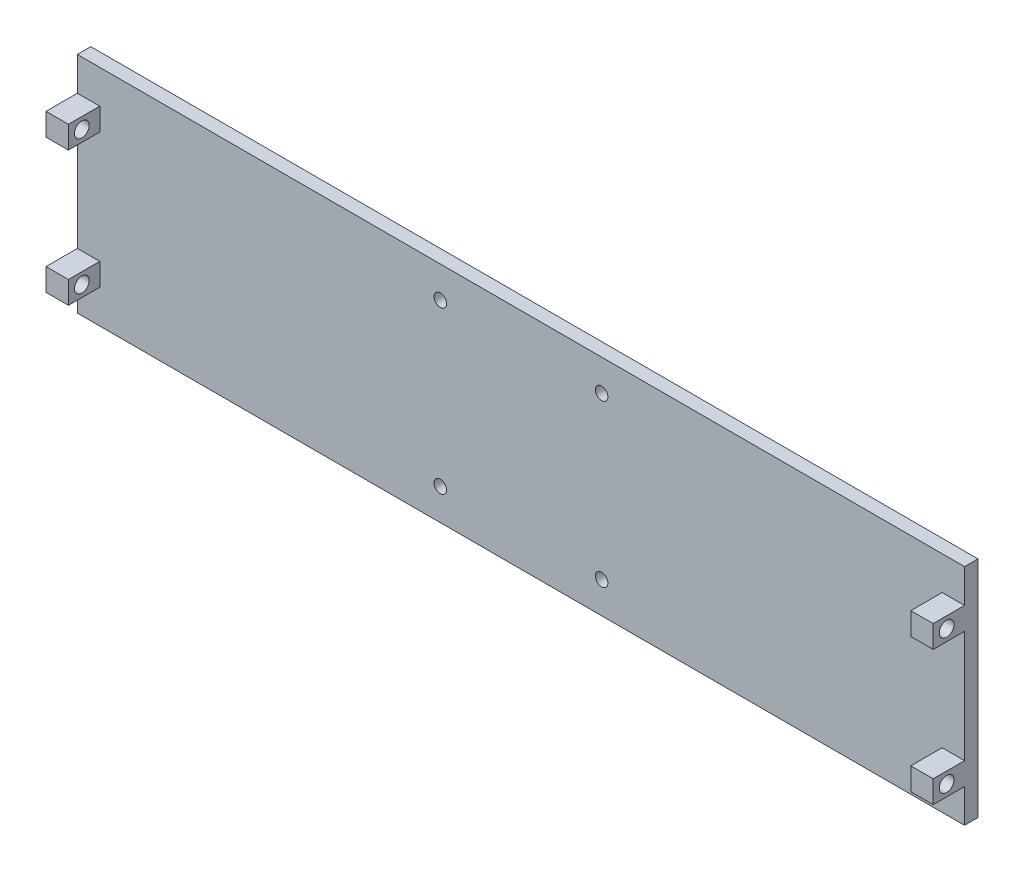
ISO-10303-21;
HEADER;
FILE_DESCRIPTION(('STEP AP214'),'2;1');
FILE_NAME('part.step','',(''),(''),'','','');
FILE_SCHEMA(('AUTOMOTIVE_DESIGN { 1 0 10303 214 1 1 1 1 }'));
ENDSEC;
DATA;
#1=APPLICATION_CONTEXT('core data for automotive mechanical design processes');
#2=APPLICATION_PROTOCOL_DEFINITION('international standard','automotive_design',2000,#1);
#3=PRODUCT_CONTEXT('',#1,'mechanical');
#4=PRODUCT('Part','Part','',(#3));
#5=PRODUCT_RELATED_PRODUCT_CATEGORY('part','',(#4));
#6=PRODUCT_DEFINITION_FORMATION('','',#4);
#7=PRODUCT_DEFINITION_CONTEXT('part definition',#1,'design');
#8=PRODUCT_DEFINITION('design','',#6,#7);
#9=PRODUCT_DEFINITION_SHAPE('','',#8);
#10=(LENGTH_UNIT() NAMED_UNIT(*) SI_UNIT(.MILLI.,.METRE.));
#11=(NAMED_UNIT(*) PLANE_ANGLE_UNIT() SI_UNIT($,.RADIAN.));
#12=(NAMED_UNIT(*) SI_UNIT($,.STERADIAN.) SOLID_ANGLE_UNIT());
#13=UNCERTAINTY_MEASURE_WITH_UNIT(LENGTH_MEASURE(1.E-05),#10,'distance_accuracy_value','');
#14=(GEOMETRIC_REPRESENTATION_CONTEXT(3) GLOBAL_UNCERTAINTY_ASSIGNED_CONTEXT((#13)) GLOBAL_UNIT_ASSIGNED_CONTEXT((#10,
#11,#12)) REPRESENTATION_CONTEXT('',''));
#15=CARTESIAN_POINT('',(0.,0.,0.));
#16=DIRECTION('',(0.,0.,1.));
#17=DIRECTION('',(1.,0.,0.));
#18=AXIS2_PLACEMENT_3D('',#15,#16,#17);
#19=CARTESIAN_POINT('',(0.,0.,3.));
#20=DIRECTION('',(0.,0.,-1.));
#21=DIRECTION('',(-1.,0.,0.));
#22=AXIS2_PLACEMENT_3D('',#19,#20,#21);
#23=PLANE('',#22);
#24=CARTESIAN_POINT('',(18.0000000000001,17.9999999999999,3.));
#25=DIRECTION('',(0.,0.,1.));
#26=DIRECTION('',(1.,0.,0.));
#27=AXIS2_PLACEMENT_3D('',#24,#25,#26);
#28=CIRCLE('',#27,1.4);
#29=CARTESIAN_POINT('',(19.4000000000001,17.9999999999999,3.));
#30=VERTEX_POINT('',#29);
#31=EDGE_CURVE('E750',#30,#30,#28,.T.);
#32=ORIENTED_EDGE('',*,*,#31,.F.);
#33=EDGE_LOOP('',(#32));
#34=FACE_BOUND('',#33,.T.);
#35=CARTESIAN_POINT('',(17.9999999999999,-18.0000000000001,3.));
#36=DIRECTION('',(0.,0.,1.));
#37=DIRECTION('',(1.,0.,0.));
#38=AXIS2_PLACEMENT_3D('',#35,#36,#37);
#39=CIRCLE('',#38,1.4);
#40=CARTESIAN_POINT('',(19.3999999999999,-18.0000000000001,3.));
#41=VERTEX_POINT('',#40);
#42=EDGE_CURVE('E757',#41,#41,#39,.T.);
#43=ORIENTED_EDGE('',*,*,#42,.F.);
#44=EDGE_LOOP('',(#43));
#45=FACE_BOUND('',#44,.T.);
#46=CARTESIAN_POINT('',(-18.0000000000002,-17.9999999999998,3.));
#47=DIRECTION('',(0.,0.,1.));
#48=DIRECTION('',(1.,0.,0.));
#49=AXIS2_PLACEMENT_3D('',#46,#47,#48);
#50=CIRCLE('',#49,1.4);
#51=CARTESIAN_POINT('',(-16.6000000000002,-17.9999999999998,3.));
#52=VERTEX_POINT('',#51);
#53=EDGE_CURVE('E767',#52,#52,#50,.T.);
#54=ORIENTED_EDGE('',*,*,#53,.F.);
#55=EDGE_LOOP('',(#54));
#56=FACE_BOUND('',#55,.T.);
#57=CARTESIAN_POINT('',(-18.,18.,3.));
#58=DIRECTION('',(0.,0.,1.));
#59=DIRECTION('',(1.,0.,0.));
#60=AXIS2_PLACEMENT_3D('',#57,#58,#59);
#61=CIRCLE('',#60,1.4);
#62=CARTESIAN_POINT('',(-16.6,18.,3.));
#63=VERTEX_POINT('',#62);
#64=EDGE_CURVE('E253',#63,#63,#61,.T.);
#65=ORIENTED_EDGE('',*,*,#64,.F.);
#66=EDGE_LOOP('',(#65));
#67=FACE_BOUND('',#66,.T.);
#68=DIRECTION('',(-1.,0.,0.));
#69=VECTOR('',#68,1.);
#70=CARTESIAN_POINT('',(0.,-12.5,3.));
#71=LINE('',#70,#69);
#72=CARTESIAN_POINT('',(99.,-12.5,3.));
#73=VERTEX_POINT('',#72);
#74=CARTESIAN_POINT('',(94.,-12.5,3.));
#75=VERTEX_POINT('',#74);
#76=EDGE_CURVE('E244',#73,#75,#71,.T.);
#77=ORIENTED_EDGE('',*,*,#76,.F.);
#78=DIRECTION('',(0.,1.,0.));
#79=VECTOR('',#78,1.);
#80=CARTESIAN_POINT('',(99.,-25.,3.));
#81=LINE('',#80,#79);
#82=CARTESIAN_POINT('',(99.,12.5,3.));
#83=VERTEX_POINT('',#82);
#84=EDGE_CURVE('E426',#73,#83,#81,.T.);
#85=ORIENTED_EDGE('',*,*,#84,.T.);
#86=DIRECTION('',(1.,0.,0.));
#87=VECTOR('',#86,1.);
#88=CARTESIAN_POINT('',(0.,12.5,3.));
#89=LINE('',#88,#87);
#90=CARTESIAN_POINT('',(94.,12.5,3.));
#91=VERTEX_POINT('',#90);
#92=EDGE_CURVE('E312',#91,#83,#89,.T.);
#93=ORIENTED_EDGE('',*,*,#92,.F.);
#94=DIRECTION('',(0.,-1.,0.));
#95=VECTOR('',#94,1.);
#96=CARTESIAN_POINT('',(94.,0.,3.));
#97=LINE('',#96,#95);
#98=CARTESIAN_POINT('',(94.,17.5,3.));
#99=VERTEX_POINT('',#98);
#100=EDGE_CURVE('E271',#99,#91,#97,.T.);
#101=ORIENTED_EDGE('',*,*,#100,.F.);
#102=DIRECTION('',(1.,0.,0.));
#103=VECTOR('',#102,1.);
#104=CARTESIAN_POINT('',(0.,17.5,3.));
#105=LINE('',#104,#103);
#106=CARTESIAN_POINT('',(99.,17.5,3.));
#107=VERTEX_POINT('',#106);
#108=EDGE_CURVE('E316',#99,#107,#105,.T.);
#109=ORIENTED_EDGE('',*,*,#108,.T.);
#110=CARTESIAN_POINT('',(99.,25.,3.));
#111=VERTEX_POINT('',#110);
#112=EDGE_CURVE('E427',#107,#111,#81,.T.);
#113=ORIENTED_EDGE('',*,*,#112,.T.);
#114=DIRECTION('',(-1.,0.,0.));
#115=VECTOR('',#114,1.);
#116=CARTESIAN_POINT('',(-99.,25.,3.));
#117=LINE('',#116,#115);
#118=CARTESIAN_POINT('',(-99.,25.,3.));
#119=VERTEX_POINT('',#118);
#120=EDGE_CURVE('E425',#111,#119,#117,.T.);
#121=ORIENTED_EDGE('',*,*,#120,.T.);
#122=DIRECTION('',(0.,-1.,0.));
#123=VECTOR('',#122,1.);
#124=CARTESIAN_POINT('',(-99.,-25.,3.));
#125=LINE('',#124,#123);
#126=CARTESIAN_POINT('',(-99.,17.5,3.));
#127=VERTEX_POINT('',#126);
#128=EDGE_CURVE('E431',#119,#127,#125,.T.);
#129=ORIENTED_EDGE('',*,*,#128,.T.);
#130=DIRECTION('',(-1.,0.,0.));
#131=VECTOR('',#130,1.);
#132=CARTESIAN_POINT('',(0.,17.5,3.));
#133=LINE('',#132,#131);
#134=CARTESIAN_POINT('',(-94.,17.5,3.));
#135=VERTEX_POINT('',#134);
#136=EDGE_CURVE('E413',#135,#127,#133,.T.);
#137=ORIENTED_EDGE('',*,*,#136,.F.);
#138=DIRECTION('',(0.,1.,0.));
#139=VECTOR('',#138,1.);
#140=CARTESIAN_POINT('',(-94.,0.,3.));
#141=LINE('',#140,#139);
#142=CARTESIAN_POINT('',(-94.,12.5,3.));
#143=VERTEX_POINT('',#142);
#144=EDGE_CURVE('E409',#143,#135,#141,.T.);
#145=ORIENTED_EDGE('',*,*,#144,.F.);
#146=DIRECTION('',(-1.,0.,0.));
#147=VECTOR('',#146,1.);
#148=CARTESIAN_POINT('',(0.,12.5,3.));
#149=LINE('',#148,#147);
#150=CARTESIAN_POINT('',(-99.,12.5,3.));
#151=VERTEX_POINT('',#150);
#152=EDGE_CURVE('E417',#143,#151,#149,.T.);
#153=ORIENTED_EDGE('',*,*,#152,.T.);
#154=CARTESIAN_POINT('',(-99.,-12.5,3.));
#155=VERTEX_POINT('',#154);
#156=EDGE_CURVE('E435',#151,#155,#125,.T.);
#157=ORIENTED_EDGE('',*,*,#156,.T.);
#158=DIRECTION('',(-1.,0.,0.));
#159=VECTOR('',#158,1.);
#160=CARTESIAN_POINT('',(0.,-12.5,3.));
#161=LINE('',#160,#159);
#162=CARTESIAN_POINT('',(-94.,-12.5,3.));
#163=VERTEX_POINT('',#162);
#164=EDGE_CURVE('E405',#163,#155,#161,.T.);
#165=ORIENTED_EDGE('',*,*,#164,.F.);
#166=DIRECTION('',(0.,1.,0.));
#167=VECTOR('',#166,1.);
#168=CARTESIAN_POINT('',(-94.,0.,3.));
#169=LINE('',#168,#167);
#170=CARTESIAN_POINT('',(-94.,-17.5,3.));
#171=VERTEX_POINT('',#170);
#172=EDGE_CURVE('E360',#171,#163,#169,.T.);
#173=ORIENTED_EDGE('',*,*,#172,.F.);
#174=DIRECTION('',(-1.,0.,0.));
#175=VECTOR('',#174,1.);
#176=CARTESIAN_POINT('',(0.,-17.5,3.));
#177=LINE('',#176,#175);
#178=CARTESIAN_POINT('',(-99.,-17.5,3.));
#179=VERTEX_POINT('',#178);
#180=EDGE_CURVE('E401',#171,#179,#177,.T.);
#181=ORIENTED_EDGE('',*,*,#180,.T.);
#182=CARTESIAN_POINT('',(-99.,-25.,3.));
#183=VERTEX_POINT('',#182);
#184=EDGE_CURVE('E430',#179,#183,#125,.T.);
#185=ORIENTED_EDGE('',*,*,#184,.T.);
#186=DIRECTION('',(1.,0.,0.));
#187=VECTOR('',#186,1.);
#188=CARTESIAN_POINT('',(-99.,-25.,3.));
#189=LINE('',#188,#187);
#190=CARTESIAN_POINT('',(99.,-25.,3.));
#191=VERTEX_POINT('',#190);
#192=EDGE_CURVE('E434',#183,#191,#189,.T.);
#193=ORIENTED_EDGE('',*,*,#192,.T.);
#194=CARTESIAN_POINT('',(99.,-17.5,3.));
#195=VERTEX_POINT('',#194);
#196=EDGE_CURVE('E422',#191,#195,#81,.T.);
#197=ORIENTED_EDGE('',*,*,#196,.T.);
#198=DIRECTION('',(-1.,0.,0.));
#199=VECTOR('',#198,1.);
#200=CARTESIAN_POINT('',(0.,-17.5,3.));
#201=LINE('',#200,#199);
#202=CARTESIAN_POINT('',(94.,-17.5,3.));
#203=VERTEX_POINT('',#202);
#204=EDGE_CURVE('E99',#195,#203,#201,.T.);
#205=ORIENTED_EDGE('',*,*,#204,.T.);
#206=DIRECTION('',(0.,-1.,0.));
#207=VECTOR('',#206,1.);
#208=CARTESIAN_POINT('',(94.,0.,3.));
#209=LINE('',#208,#207);
#210=EDGE_CURVE('E103',#75,#203,#209,.T.);
#211=ORIENTED_EDGE('',*,*,#210,.F.);
#212=EDGE_LOOP('',(#77,#85,#93,#101,#109,#113,#121,#129,#137,#145,#153,#157,#165,#173,#181,#185,
#193,#197,#205,#211));
#213=FACE_BOUND('',#212,.T.);
#214=ADVANCED_FACE('F83',(#34,#45,#56,#67,#213),#23,.F.);
#215=CARTESIAN_POINT('',(99.,-25.,3.));
#216=DIRECTION('',(-1.,0.,0.));
#217=DIRECTION('',(0.,0.,1.));
#218=AXIS2_PLACEMENT_3D('',#215,#216,#217);
#219=PLANE('',#218);
#220=ORIENTED_EDGE('',*,*,#112,.F.);
#221=DIRECTION('',(0.,0.,1.));
#222=VECTOR('',#221,1.);
#223=CARTESIAN_POINT('',(99.,17.5,0.));
#224=LINE('',#223,#222);
#225=CARTESIAN_POINT('',(99.,17.5,10.));
#226=VERTEX_POINT('',#225);
#227=EDGE_CURVE('E291',#107,#226,#224,.T.);
#228=ORIENTED_EDGE('',*,*,#227,.T.);
#229=DIRECTION('',(0.,1.,0.));
#230=VECTOR('',#229,1.);
#231=CARTESIAN_POINT('',(99.,12.5,10.));
#232=LINE('',#231,#230);
#233=CARTESIAN_POINT('',(99.,12.5,10.));
#234=VERTEX_POINT('',#233);
#235=EDGE_CURVE('E286',#234,#226,#232,.T.);
#236=ORIENTED_EDGE('',*,*,#235,.F.);
#237=DIRECTION('',(0.,0.,1.));
#238=VECTOR('',#237,1.);
#239=CARTESIAN_POINT('',(99.,12.5,0.));
#240=LINE('',#239,#238);
#241=EDGE_CURVE('E283',#83,#234,#240,.T.);
#242=ORIENTED_EDGE('',*,*,#241,.F.);
#243=ORIENTED_EDGE('',*,*,#84,.F.);
#244=DIRECTION('',(0.,0.,-1.));
#245=VECTOR('',#244,1.);
#246=CARTESIAN_POINT('',(99.,-12.5,0.));
#247=LINE('',#246,#245);
#248=CARTESIAN_POINT('',(99.,-12.5,10.));
#249=VERTEX_POINT('',#248);
#250=EDGE_CURVE('E261',#249,#73,#247,.T.);
#251=ORIENTED_EDGE('',*,*,#250,.F.);
#252=DIRECTION('',(0.,1.,0.));
#253=VECTOR('',#252,1.);
#254=CARTESIAN_POINT('',(99.,0.,10.));
#255=LINE('',#254,#253);
#256=CARTESIAN_POINT('',(99.,-17.5,10.));
#257=VERTEX_POINT('',#256);
#258=EDGE_CURVE('E235',#257,#249,#255,.T.);
#259=ORIENTED_EDGE('',*,*,#258,.F.);
#260=DIRECTION('',(0.,0.,-1.));
#261=VECTOR('',#260,1.);
#262=CARTESIAN_POINT('',(99.,-17.5,0.));
#263=LINE('',#262,#261);
#264=EDGE_CURVE('E250',#257,#195,#263,.T.);
#265=ORIENTED_EDGE('',*,*,#264,.T.);
#266=ORIENTED_EDGE('',*,*,#196,.F.);
#267=DIRECTION('',(0.,0.,-1.));
#268=VECTOR('',#267,1.);
#269=CARTESIAN_POINT('',(99.,-25.,3.));
#270=LINE('',#269,#268);
#271=CARTESIAN_POINT('',(99.,-25.,0.));
#272=VERTEX_POINT('',#271);
#273=EDGE_CURVE('E438',#191,#272,#270,.T.);
#274=ORIENTED_EDGE('',*,*,#273,.T.);
#275=DIRECTION('',(0.,1.,0.));
#276=VECTOR('',#275,1.);
#277=CARTESIAN_POINT('',(99.,-25.,0.));
#278=LINE('',#277,#276);
#279=CARTESIAN_POINT('',(99.,25.,0.));
#280=VERTEX_POINT('',#279);
#281=EDGE_CURVE('E421',#272,#280,#278,.T.);
#282=ORIENTED_EDGE('',*,*,#281,.T.);
#283=DIRECTION('',(0.,0.,-1.));
#284=VECTOR('',#283,1.);
#285=CARTESIAN_POINT('',(99.,25.,3.));
#286=LINE('',#285,#284);
#287=EDGE_CURVE('E12',#111,#280,#286,.T.);
#288=ORIENTED_EDGE('',*,*,#287,.F.);
#289=EDGE_LOOP('',(#220,#228,#236,#242,#243,#251,#259,#265,#266,#274,#282,#288));
#290=FACE_BOUND('',#289,.T.);
#291=CARTESIAN_POINT('',(99.,15.,7.));
#292=DIRECTION('',(1.,0.,0.));
#293=DIRECTION('',(0.,0.,-1.));
#294=AXIS2_PLACEMENT_3D('',#291,#292,#293);
#295=CIRCLE('',#294,1.65);
#296=CARTESIAN_POINT('',(99.,15.,5.35));
#297=VERTEX_POINT('',#296);
#298=EDGE_CURVE('E264',#297,#297,#295,.T.);
#299=ORIENTED_EDGE('',*,*,#298,.F.);
#300=EDGE_LOOP('',(#299));
#301=FACE_BOUND('',#300,.T.);
#302=CARTESIAN_POINT('',(99.,-15.,7.));
#303=DIRECTION('',(1.,0.,0.));
#304=DIRECTION('',(0.,0.,-1.));
#305=AXIS2_PLACEMENT_3D('',#302,#303,#304);
#306=CIRCLE('',#305,1.65);
#307=CARTESIAN_POINT('',(99.,-15.,5.35));
#308=VERTEX_POINT('',#307);
#309=EDGE_CURVE('E246',#308,#308,#306,.T.);
#310=ORIENTED_EDGE('',*,*,#309,.F.);
#311=EDGE_LOOP('',(#310));
#312=FACE_BOUND('',#311,.T.);
#313=ADVANCED_FACE('F85',(#290,#301,#312),#219,.F.);
#314=CARTESIAN_POINT('',(-99.,25.,3.));
#315=DIRECTION('',(0.,-1.,0.));
#316=DIRECTION('',(0.,0.,-1.));
#317=AXIS2_PLACEMENT_3D('',#314,#315,#316);
#318=PLANE('',#317);
#319=DIRECTION('',(-1.,0.,0.));
#320=VECTOR('',#319,1.);
#321=CARTESIAN_POINT('',(-99.,25.,0.));
#322=LINE('',#321,#320);
#323=CARTESIAN_POINT('',(-99.,25.,0.));
#324=VERTEX_POINT('',#323);
#325=EDGE_CURVE('E441',#280,#324,#322,.T.);
#326=ORIENTED_EDGE('',*,*,#325,.T.);
#327=DIRECTION('',(0.,0.,-1.));
#328=VECTOR('',#327,1.);
#329=CARTESIAN_POINT('',(-99.,25.,3.));
#330=LINE('',#329,#328);
#331=EDGE_CURVE('E92',#119,#324,#330,.T.);
#332=ORIENTED_EDGE('',*,*,#331,.F.);
#333=ORIENTED_EDGE('',*,*,#120,.F.);
#334=ORIENTED_EDGE('',*,*,#287,.T.);
#335=EDGE_LOOP('',(#326,#332,#333,#334));
#336=FACE_BOUND('',#335,.T.);
#337=ADVANCED_FACE('F491',(#336),#318,.F.);
#338=CARTESIAN_POINT('',(-99.,-25.,3.));
#339=DIRECTION('',(1.,0.,0.));
#340=DIRECTION('',(0.,0.,-1.));
#341=AXIS2_PLACEMENT_3D('',#338,#339,#340);
#342=PLANE('',#341);
#343=ORIENTED_EDGE('',*,*,#184,.F.);
#344=DIRECTION('',(0.,0.,1.));
#345=VECTOR('',#344,1.);
#346=CARTESIAN_POINT('',(-99.,-17.5,0.));
#347=LINE('',#346,#345);
#348=CARTESIAN_POINT('',(-99.,-17.5,10.));
#349=VERTEX_POINT('',#348);
#350=EDGE_CURVE('E382',#179,#349,#347,.T.);
#351=ORIENTED_EDGE('',*,*,#350,.T.);
#352=DIRECTION('',(0.,1.,0.));
#353=VECTOR('',#352,1.);
#354=CARTESIAN_POINT('',(-99.,0.,10.));
#355=LINE('',#354,#353);
#356=CARTESIAN_POINT('',(-99.,-12.5,10.));
#357=VERTEX_POINT('',#356);
#358=EDGE_CURVE('E385',#349,#357,#355,.T.);
#359=ORIENTED_EDGE('',*,*,#358,.T.);
#360=DIRECTION('',(0.,0.,1.));
#361=VECTOR('',#360,1.);
#362=CARTESIAN_POINT('',(-99.,-12.5,0.));
#363=LINE('',#362,#361);
#364=EDGE_CURVE('E325',#155,#357,#363,.T.);
#365=ORIENTED_EDGE('',*,*,#364,.F.);
#366=ORIENTED_EDGE('',*,*,#156,.F.);
#367=DIRECTION('',(0.,0.,1.));
#368=VECTOR('',#367,1.);
#369=CARTESIAN_POINT('',(-99.,12.5,0.));
#370=LINE('',#369,#368);
#371=CARTESIAN_POINT('',(-99.,12.5,10.));
#372=VERTEX_POINT('',#371);
#373=EDGE_CURVE('E350',#151,#372,#370,.T.);
#374=ORIENTED_EDGE('',*,*,#373,.T.);
#375=DIRECTION('',(0.,1.,0.));
#376=VECTOR('',#375,1.);
#377=CARTESIAN_POINT('',(-99.,0.,10.));
#378=LINE('',#377,#376);
#379=CARTESIAN_POINT('',(-99.,17.5,10.));
#380=VERTEX_POINT('',#379);
#381=EDGE_CURVE('E342',#372,#380,#378,.T.);
#382=ORIENTED_EDGE('',*,*,#381,.T.);
#383=DIRECTION('',(0.,0.,1.));
#384=VECTOR('',#383,1.);
#385=CARTESIAN_POINT('',(-99.,17.5,0.));
#386=LINE('',#385,#384);
#387=EDGE_CURVE('E346',#127,#380,#386,.T.);
#388=ORIENTED_EDGE('',*,*,#387,.F.);
#389=ORIENTED_EDGE('',*,*,#128,.F.);
#390=ORIENTED_EDGE('',*,*,#331,.T.);
#391=DIRECTION('',(0.,-1.,0.));
#392=VECTOR('',#391,1.);
#393=CARTESIAN_POINT('',(-99.,-25.,0.));
#394=LINE('',#393,#392);
#395=CARTESIAN_POINT('',(-99.,-25.,0.));
#396=VERTEX_POINT('',#395);
#397=EDGE_CURVE('E444',#324,#396,#394,.T.);
#398=ORIENTED_EDGE('',*,*,#397,.T.);
#399=DIRECTION('',(0.,0.,-1.));
#400=VECTOR('',#399,1.);
#401=CARTESIAN_POINT('',(-99.,-25.,3.));
#402=LINE('',#401,#400);
#403=EDGE_CURVE('E453',#183,#396,#402,.T.);
#404=ORIENTED_EDGE('',*,*,#403,.F.);
#405=EDGE_LOOP('',(#343,#351,#359,#365,#366,#374,#382,#388,#389,#390,#398,#404));
#406=FACE_BOUND('',#405,.T.);
#407=CARTESIAN_POINT('',(-99.,-15.,7.));
#408=DIRECTION('',(-1.,0.,0.));
#409=DIRECTION('',(0.,0.,1.));
#410=AXIS2_PLACEMENT_3D('',#407,#408,#409);
#411=CIRCLE('',#410,1.65);
#412=CARTESIAN_POINT('',(-99.,-15.,8.65));
#413=VERTEX_POINT('',#412);
#414=EDGE_CURVE('E368',#413,#413,#411,.T.);
#415=ORIENTED_EDGE('',*,*,#414,.F.);
#416=EDGE_LOOP('',(#415));
#417=FACE_BOUND('',#416,.T.);
#418=CARTESIAN_POINT('',(-99.,15.,7.));
#419=DIRECTION('',(-1.,0.,0.));
#420=DIRECTION('',(0.,0.,1.));
#421=AXIS2_PLACEMENT_3D('',#418,#419,#420);
#422=CIRCLE('',#421,1.65);
#423=CARTESIAN_POINT('',(-99.,15.,8.65));
#424=VERTEX_POINT('',#423);
#425=EDGE_CURVE('E331',#424,#424,#422,.T.);
#426=ORIENTED_EDGE('',*,*,#425,.F.);
#427=EDGE_LOOP('',(#426));
#428=FACE_BOUND('',#427,.T.);
#429=ADVANCED_FACE('F462',(#406,#417,#428),#342,.F.);
#430=CARTESIAN_POINT('',(-99.,-25.,3.));
#431=DIRECTION('',(0.,1.,0.));
#432=DIRECTION('',(0.,0.,1.));
#433=AXIS2_PLACEMENT_3D('',#430,#431,#432);
#434=PLANE('',#433);
#435=DIRECTION('',(1.,0.,0.));
#436=VECTOR('',#435,1.);
#437=CARTESIAN_POINT('',(-99.,-25.,0.));
#438=LINE('',#437,#436);
#439=EDGE_CURVE('E447',#396,#272,#438,.T.);
#440=ORIENTED_EDGE('',*,*,#439,.T.);
#441=ORIENTED_EDGE('',*,*,#273,.F.);
#442=ORIENTED_EDGE('',*,*,#192,.F.);
#443=ORIENTED_EDGE('',*,*,#403,.T.);
#444=EDGE_LOOP('',(#440,#441,#442,#443));
#445=FACE_BOUND('',#444,.T.);
#446=ADVANCED_FACE('F475',(#445),#434,.F.);
#447=CARTESIAN_POINT('',(0.,0.,0.));
#448=DIRECTION('',(0.,0.,-1.));
#449=DIRECTION('',(-1.,0.,0.));
#450=AXIS2_PLACEMENT_3D('',#447,#448,#449);
#451=PLANE('',#450);
#452=CARTESIAN_POINT('',(18.0000000000001,17.9999999999999,0.));
#453=DIRECTION('',(0.,0.,1.));
#454=DIRECTION('',(1.,0.,0.));
#455=AXIS2_PLACEMENT_3D('',#452,#453,#454);
#456=CIRCLE('',#455,1.4);
#457=CARTESIAN_POINT('',(19.4000000000001,17.9999999999999,0.));
#458=VERTEX_POINT('',#457);
#459=EDGE_CURVE('E748',#458,#458,#456,.T.);
#460=ORIENTED_EDGE('',*,*,#459,.T.);
#461=EDGE_LOOP('',(#460));
#462=FACE_BOUND('',#461,.T.);
#463=CARTESIAN_POINT('',(17.9999999999999,-18.0000000000001,0.));
#464=DIRECTION('',(0.,0.,1.));
#465=DIRECTION('',(1.,0.,0.));
#466=AXIS2_PLACEMENT_3D('',#463,#464,#465);
#467=CIRCLE('',#466,1.4);
#468=CARTESIAN_POINT('',(19.3999999999999,-18.0000000000001,0.));
#469=VERTEX_POINT('',#468);
#470=EDGE_CURVE('E752',#469,#469,#467,.T.);
#471=ORIENTED_EDGE('',*,*,#470,.T.);
#472=EDGE_LOOP('',(#471));
#473=FACE_BOUND('',#472,.T.);
#474=CARTESIAN_POINT('',(-18.0000000000002,-17.9999999999998,0.));
#475=DIRECTION('',(0.,0.,1.));
#476=DIRECTION('',(1.,0.,0.));
#477=AXIS2_PLACEMENT_3D('',#474,#475,#476);
#478=CIRCLE('',#477,1.4);
#479=CARTESIAN_POINT('',(-16.6000000000002,-17.9999999999998,0.));
#480=VERTEX_POINT('',#479);
#481=EDGE_CURVE('E772',#480,#480,#478,.T.);
#482=ORIENTED_EDGE('',*,*,#481,.T.);
#483=EDGE_LOOP('',(#482));
#484=FACE_BOUND('',#483,.T.);
#485=CARTESIAN_POINT('',(-18.,18.,0.));
#486=DIRECTION('',(0.,0.,1.));
#487=DIRECTION('',(1.,0.,0.));
#488=AXIS2_PLACEMENT_3D('',#485,#486,#487);
#489=CIRCLE('',#488,1.4);
#490=CARTESIAN_POINT('',(-16.6,18.,0.));
#491=VERTEX_POINT('',#490);
#492=EDGE_CURVE('E282',#491,#491,#489,.T.);
#493=ORIENTED_EDGE('',*,*,#492,.T.);
#494=EDGE_LOOP('',(#493));
#495=FACE_BOUND('',#494,.T.);
#496=ORIENTED_EDGE('',*,*,#325,.F.);
#497=ORIENTED_EDGE('',*,*,#281,.F.);
#498=ORIENTED_EDGE('',*,*,#439,.F.);
#499=ORIENTED_EDGE('',*,*,#397,.F.);
#500=EDGE_LOOP('',(#496,#497,#498,#499));
#501=FACE_BOUND('',#500,.T.);
#502=ADVANCED_FACE('F471',(#462,#473,#484,#495,#501),#451,.T.);
#503=CARTESIAN_POINT('',(-94.,-12.5,0.));
#504=DIRECTION('',(0.,-1.,0.));
#505=DIRECTION('',(0.,0.,-1.));
#506=AXIS2_PLACEMENT_3D('',#503,#504,#505);
#507=PLANE('',#506);
#508=DIRECTION('',(0.,0.,1.));
#509=VECTOR('',#508,1.);
#510=CARTESIAN_POINT('',(-94.,-12.5,0.));
#511=LINE('',#510,#509);
#512=CARTESIAN_POINT('',(-94.,-12.5,10.));
#513=VERTEX_POINT('',#512);
#514=EDGE_CURVE('E364',#163,#513,#511,.T.);
#515=ORIENTED_EDGE('',*,*,#514,.F.);
#516=ORIENTED_EDGE('',*,*,#164,.T.);
#517=ORIENTED_EDGE('',*,*,#364,.T.);
#518=DIRECTION('',(-1.,0.,0.));
#519=VECTOR('',#518,1.);
#520=CARTESIAN_POINT('',(-94.,-12.5,10.));
#521=LINE('',#520,#519);
#522=EDGE_CURVE('E347',#513,#357,#521,.T.);
#523=ORIENTED_EDGE('',*,*,#522,.F.);
#524=EDGE_LOOP('',(#515,#516,#517,#523));
#525=FACE_BOUND('',#524,.T.);
#526=ADVANCED_FACE('F510',(#525),#507,.F.);
#527=CARTESIAN_POINT('',(-94.,-17.5,0.));
#528=DIRECTION('',(0.,-1.,0.));
#529=DIRECTION('',(0.,0.,-1.));
#530=AXIS2_PLACEMENT_3D('',#527,#528,#529);
#531=PLANE('',#530);
#532=ORIENTED_EDGE('',*,*,#180,.F.);
#533=DIRECTION('',(0.,0.,1.));
#534=VECTOR('',#533,1.);
#535=CARTESIAN_POINT('',(-94.,-17.5,0.));
#536=LINE('',#535,#534);
#537=CARTESIAN_POINT('',(-94.,-17.5,10.));
#538=VERTEX_POINT('',#537);
#539=EDGE_CURVE('E367',#171,#538,#536,.T.);
#540=ORIENTED_EDGE('',*,*,#539,.T.);
#541=DIRECTION('',(-1.,0.,0.));
#542=VECTOR('',#541,1.);
#543=CARTESIAN_POINT('',(-94.,-17.5,10.));
#544=LINE('',#543,#542);
#545=EDGE_CURVE('E379',#538,#349,#544,.T.);
#546=ORIENTED_EDGE('',*,*,#545,.T.);
#547=ORIENTED_EDGE('',*,*,#350,.F.);
#548=EDGE_LOOP('',(#532,#540,#546,#547));
#549=FACE_BOUND('',#548,.T.);
#550=ADVANCED_FACE('F530',(#549),#531,.T.);
#551=CARTESIAN_POINT('',(-94.,0.,0.));
#552=DIRECTION('',(-1.,0.,0.));
#553=DIRECTION('',(0.,0.,1.));
#554=AXIS2_PLACEMENT_3D('',#551,#552,#553);
#555=PLANE('',#554);
#556=CARTESIAN_POINT('',(-94.,-15.,7.));
#557=DIRECTION('',(-1.,0.,0.));
#558=DIRECTION('',(0.,0.,1.));
#559=AXIS2_PLACEMENT_3D('',#556,#557,#558);
#560=CIRCLE('',#559,1.65);
#561=CARTESIAN_POINT('',(-94.,-15.,8.65));
#562=VERTEX_POINT('',#561);
#563=EDGE_CURVE('E375',#562,#562,#560,.T.);
#564=ORIENTED_EDGE('',*,*,#563,.T.);
#565=EDGE_LOOP('',(#564));
#566=FACE_BOUND('',#565,.T.);
#567=ORIENTED_EDGE('',*,*,#539,.F.);
#568=ORIENTED_EDGE('',*,*,#172,.T.);
#569=ORIENTED_EDGE('',*,*,#514,.T.);
#570=DIRECTION('',(0.,1.,0.));
#571=VECTOR('',#570,1.);
#572=CARTESIAN_POINT('',(-94.,0.,10.));
#573=LINE('',#572,#571);
#574=EDGE_CURVE('E371',#538,#513,#573,.T.);
#575=ORIENTED_EDGE('',*,*,#574,.F.);
#576=EDGE_LOOP('',(#567,#568,#569,#575));
#577=FACE_BOUND('',#576,.T.);
#578=ADVANCED_FACE('F538',(#566,#577),#555,.F.);
#579=CARTESIAN_POINT('',(-94.,0.,10.));
#580=DIRECTION('',(0.,0.,1.));
#581=DIRECTION('',(1.,0.,0.));
#582=AXIS2_PLACEMENT_3D('',#579,#580,#581);
#583=PLANE('',#582);
#584=ORIENTED_EDGE('',*,*,#358,.F.);
#585=ORIENTED_EDGE('',*,*,#545,.F.);
#586=ORIENTED_EDGE('',*,*,#574,.T.);
#587=ORIENTED_EDGE('',*,*,#522,.T.);
#588=EDGE_LOOP('',(#584,#585,#586,#587));
#589=FACE_BOUND('',#588,.T.);
#590=ADVANCED_FACE('F547',(#589),#583,.T.);
#591=CARTESIAN_POINT('',(-94.,-15.,7.));
#592=DIRECTION('',(-1.,0.,0.));
#593=DIRECTION('',(0.,0.,1.));
#594=AXIS2_PLACEMENT_3D('',#591,#592,#593);
#595=CYLINDRICAL_SURFACE('',#594,1.65);
#596=ORIENTED_EDGE('',*,*,#563,.F.);
#597=EDGE_LOOP('',(#596));
#598=FACE_BOUND('',#597,.T.);
#599=ORIENTED_EDGE('',*,*,#414,.T.);
#600=EDGE_LOOP('',(#599));
#601=FACE_BOUND('',#600,.T.);
#602=ADVANCED_FACE('F556',(#598,#601),#595,.F.);
#603=CARTESIAN_POINT('',(-94.,12.5,0.));
#604=DIRECTION('',(0.,-1.,0.));
#605=DIRECTION('',(0.,0.,-1.));
#606=AXIS2_PLACEMENT_3D('',#603,#604,#605);
#607=PLANE('',#606);
#608=ORIENTED_EDGE('',*,*,#152,.F.);
#609=DIRECTION('',(0.,0.,1.));
#610=VECTOR('',#609,1.);
#611=CARTESIAN_POINT('',(-94.,12.5,0.));
#612=LINE('',#611,#610);
#613=CARTESIAN_POINT('',(-94.,12.5,10.));
#614=VERTEX_POINT('',#613);
#615=EDGE_CURVE('E334',#143,#614,#612,.T.);
#616=ORIENTED_EDGE('',*,*,#615,.T.);
#617=DIRECTION('',(-1.,0.,0.));
#618=VECTOR('',#617,1.);
#619=CARTESIAN_POINT('',(-94.,12.5,10.));
#620=LINE('',#619,#618);
#621=EDGE_CURVE('E356',#614,#372,#620,.T.);
#622=ORIENTED_EDGE('',*,*,#621,.T.);
#623=ORIENTED_EDGE('',*,*,#373,.F.);
#624=EDGE_LOOP('',(#608,#616,#622,#623));
#625=FACE_BOUND('',#624,.T.);
#626=ADVANCED_FACE('F565',(#625),#607,.T.);
#627=CARTESIAN_POINT('',(-94.,17.5,0.));
#628=DIRECTION('',(0.,-1.,0.));
#629=DIRECTION('',(0.,0.,-1.));
#630=AXIS2_PLACEMENT_3D('',#627,#628,#629);
#631=PLANE('',#630);
#632=DIRECTION('',(0.,0.,1.));
#633=VECTOR('',#632,1.);
#634=CARTESIAN_POINT('',(-94.,17.5,0.));
#635=LINE('',#634,#633);
#636=CARTESIAN_POINT('',(-94.,17.5,10.));
#637=VERTEX_POINT('',#636);
#638=EDGE_CURVE('E330',#135,#637,#635,.T.);
#639=ORIENTED_EDGE('',*,*,#638,.F.);
#640=ORIENTED_EDGE('',*,*,#136,.T.);
#641=ORIENTED_EDGE('',*,*,#387,.T.);
#642=DIRECTION('',(-1.,0.,0.));
#643=VECTOR('',#642,1.);
#644=CARTESIAN_POINT('',(-94.,17.5,10.));
#645=LINE('',#644,#643);
#646=EDGE_CURVE('E341',#637,#380,#645,.T.);
#647=ORIENTED_EDGE('',*,*,#646,.F.);
#648=EDGE_LOOP('',(#639,#640,#641,#647));
#649=FACE_BOUND('',#648,.T.);
#650=ADVANCED_FACE('F574',(#649),#631,.F.);
#651=CARTESIAN_POINT('',(-94.,0.,0.));
#652=DIRECTION('',(-1.,0.,0.));
#653=DIRECTION('',(0.,0.,1.));
#654=AXIS2_PLACEMENT_3D('',#651,#652,#653);
#655=PLANE('',#654);
#656=CARTESIAN_POINT('',(-94.,15.,7.));
#657=DIRECTION('',(-1.,0.,0.));
#658=DIRECTION('',(0.,0.,1.));
#659=AXIS2_PLACEMENT_3D('',#656,#657,#658);
#660=CIRCLE('',#659,1.65);
#661=CARTESIAN_POINT('',(-94.,15.,8.65));
#662=VERTEX_POINT('',#661);
#663=EDGE_CURVE('E337',#662,#662,#660,.T.);
#664=ORIENTED_EDGE('',*,*,#663,.T.);
#665=EDGE_LOOP('',(#664));
#666=FACE_BOUND('',#665,.T.);
#667=ORIENTED_EDGE('',*,*,#615,.F.);
#668=ORIENTED_EDGE('',*,*,#144,.T.);
#669=ORIENTED_EDGE('',*,*,#638,.T.);
#670=DIRECTION('',(0.,1.,0.));
#671=VECTOR('',#670,1.);
#672=CARTESIAN_POINT('',(-94.,0.,10.));
#673=LINE('',#672,#671);
#674=EDGE_CURVE('E326',#614,#637,#673,.T.);
#675=ORIENTED_EDGE('',*,*,#674,.F.);
#676=EDGE_LOOP('',(#667,#668,#669,#675));
#677=FACE_BOUND('',#676,.T.);
#678=ADVANCED_FACE('F583',(#666,#677),#655,.F.);
#679=CARTESIAN_POINT('',(-94.,0.,10.));
#680=DIRECTION('',(0.,0.,1.));
#681=DIRECTION('',(1.,0.,0.));
#682=AXIS2_PLACEMENT_3D('',#679,#680,#681);
#683=PLANE('',#682);
#684=ORIENTED_EDGE('',*,*,#381,.F.);
#685=ORIENTED_EDGE('',*,*,#621,.F.);
#686=ORIENTED_EDGE('',*,*,#674,.T.);
#687=ORIENTED_EDGE('',*,*,#646,.T.);
#688=EDGE_LOOP('',(#684,#685,#686,#687));
#689=FACE_BOUND('',#688,.T.);
#690=ADVANCED_FACE('F593',(#689),#683,.T.);
#691=CARTESIAN_POINT('',(-94.,15.,7.));
#692=DIRECTION('',(-1.,0.,0.));
#693=DIRECTION('',(0.,0.,1.));
#694=AXIS2_PLACEMENT_3D('',#691,#692,#693);
#695=CYLINDRICAL_SURFACE('',#694,1.65);
#696=ORIENTED_EDGE('',*,*,#663,.F.);
#697=EDGE_LOOP('',(#696));
#698=FACE_BOUND('',#697,.T.);
#699=ORIENTED_EDGE('',*,*,#425,.T.);
#700=EDGE_LOOP('',(#699));
#701=FACE_BOUND('',#700,.T.);
#702=ADVANCED_FACE('F602',(#698,#701),#695,.F.);
#703=CARTESIAN_POINT('',(94.,17.5,0.));
#704=DIRECTION('',(0.,1.,0.));
#705=DIRECTION('',(0.,0.,1.));
#706=AXIS2_PLACEMENT_3D('',#703,#704,#705);
#707=PLANE('',#706);
#708=ORIENTED_EDGE('',*,*,#108,.F.);
#709=DIRECTION('',(0.,0.,1.));
#710=VECTOR('',#709,1.);
#711=CARTESIAN_POINT('',(94.,17.5,0.));
#712=LINE('',#711,#710);
#713=CARTESIAN_POINT('',(94.,17.5,10.));
#714=VERTEX_POINT('',#713);
#715=EDGE_CURVE('E287',#99,#714,#712,.T.);
#716=ORIENTED_EDGE('',*,*,#715,.T.);
#717=DIRECTION('',(1.,0.,0.));
#718=VECTOR('',#717,1.);
#719=CARTESIAN_POINT('',(94.,17.5,10.));
#720=LINE('',#719,#718);
#721=EDGE_CURVE('E273',#714,#226,#720,.T.);
#722=ORIENTED_EDGE('',*,*,#721,.T.);
#723=ORIENTED_EDGE('',*,*,#227,.F.);
#724=EDGE_LOOP('',(#708,#716,#722,#723));
#725=FACE_BOUND('',#724,.T.);
#726=ADVANCED_FACE('F610',(#725),#707,.T.);
#727=CARTESIAN_POINT('',(94.,12.5,0.));
#728=DIRECTION('',(0.,1.,0.));
#729=DIRECTION('',(0.,0.,1.));
#730=AXIS2_PLACEMENT_3D('',#727,#728,#729);
#731=PLANE('',#730);
#732=DIRECTION('',(0.,0.,1.));
#733=VECTOR('',#732,1.);
#734=CARTESIAN_POINT('',(94.,12.5,0.));
#735=LINE('',#734,#733);
#736=CARTESIAN_POINT('',(94.,12.5,10.));
#737=VERTEX_POINT('',#736);
#738=EDGE_CURVE('E277',#91,#737,#735,.T.);
#739=ORIENTED_EDGE('',*,*,#738,.F.);
#740=ORIENTED_EDGE('',*,*,#92,.T.);
#741=ORIENTED_EDGE('',*,*,#241,.T.);
#742=DIRECTION('',(1.,0.,0.));
#743=VECTOR('',#742,1.);
#744=CARTESIAN_POINT('',(94.,12.5,10.));
#745=LINE('',#744,#743);
#746=EDGE_CURVE('E278',#737,#234,#745,.T.);
#747=ORIENTED_EDGE('',*,*,#746,.F.);
#748=EDGE_LOOP('',(#739,#740,#741,#747));
#749=FACE_BOUND('',#748,.T.);
#750=ADVANCED_FACE('F626',(#749),#731,.F.);
#751=CARTESIAN_POINT('',(94.,0.,0.));
#752=DIRECTION('',(1.,0.,0.));
#753=DIRECTION('',(0.,0.,-1.));
#754=AXIS2_PLACEMENT_3D('',#751,#752,#753);
#755=PLANE('',#754);
#756=CARTESIAN_POINT('',(94.,15.,7.));
#757=DIRECTION('',(1.,0.,0.));
#758=DIRECTION('',(0.,0.,-1.));
#759=AXIS2_PLACEMENT_3D('',#756,#757,#758);
#760=CIRCLE('',#759,1.65);
#761=CARTESIAN_POINT('',(94.,15.,5.35));
#762=VERTEX_POINT('',#761);
#763=EDGE_CURVE('E294',#762,#762,#760,.T.);
#764=ORIENTED_EDGE('',*,*,#763,.T.);
#765=EDGE_LOOP('',(#764));
#766=FACE_BOUND('',#765,.T.);
#767=ORIENTED_EDGE('',*,*,#715,.F.);
#768=ORIENTED_EDGE('',*,*,#100,.T.);
#769=ORIENTED_EDGE('',*,*,#738,.T.);
#770=DIRECTION('',(0.,1.,0.));
#771=VECTOR('',#770,1.);
#772=CARTESIAN_POINT('',(94.,12.5,10.));
#773=LINE('',#772,#771);
#774=EDGE_CURVE('E297',#737,#714,#773,.T.);
#775=ORIENTED_EDGE('',*,*,#774,.T.);
#776=EDGE_LOOP('',(#767,#768,#769,#775));
#777=FACE_BOUND('',#776,.T.);
#778=ADVANCED_FACE('F635',(#766,#777),#755,.F.);
#779=CARTESIAN_POINT('',(94.,12.5,10.));
#780=DIRECTION('',(0.,0.,-1.));
#781=DIRECTION('',(-1.,0.,0.));
#782=AXIS2_PLACEMENT_3D('',#779,#780,#781);
#783=PLANE('',#782);
#784=ORIENTED_EDGE('',*,*,#235,.T.);
#785=ORIENTED_EDGE('',*,*,#721,.F.);
#786=ORIENTED_EDGE('',*,*,#774,.F.);
#787=ORIENTED_EDGE('',*,*,#746,.T.);
#788=EDGE_LOOP('',(#784,#785,#786,#787));
#789=FACE_BOUND('',#788,.T.);
#790=ADVANCED_FACE('F644',(#789),#783,.F.);
#791=CARTESIAN_POINT('',(94.,15.,7.));
#792=DIRECTION('',(1.,0.,0.));
#793=DIRECTION('',(0.,0.,-1.));
#794=AXIS2_PLACEMENT_3D('',#791,#792,#793);
#795=CYLINDRICAL_SURFACE('',#794,1.65);
#796=ORIENTED_EDGE('',*,*,#763,.F.);
#797=EDGE_LOOP('',(#796));
#798=FACE_BOUND('',#797,.T.);
#799=ORIENTED_EDGE('',*,*,#298,.T.);
#800=EDGE_LOOP('',(#799));
#801=FACE_BOUND('',#800,.T.);
#802=ADVANCED_FACE('F653',(#798,#801),#795,.F.);
#803=CARTESIAN_POINT('',(94.,-12.5,0.));
#804=DIRECTION('',(0.,-1.,0.));
#805=DIRECTION('',(0.,0.,-1.));
#806=AXIS2_PLACEMENT_3D('',#803,#804,#805);
#807=PLANE('',#806);
#808=ORIENTED_EDGE('',*,*,#250,.T.);
#809=ORIENTED_EDGE('',*,*,#76,.T.);
#810=DIRECTION('',(0.,0.,-1.));
#811=VECTOR('',#810,1.);
#812=CARTESIAN_POINT('',(94.,-12.5,0.));
#813=LINE('',#812,#811);
#814=CARTESIAN_POINT('',(94.,-12.5,10.));
#815=VERTEX_POINT('',#814);
#816=EDGE_CURVE('E225',#815,#75,#813,.T.);
#817=ORIENTED_EDGE('',*,*,#816,.F.);
#818=DIRECTION('',(1.,0.,0.));
#819=VECTOR('',#818,1.);
#820=CARTESIAN_POINT('',(94.,-12.5,10.));
#821=LINE('',#820,#819);
#822=EDGE_CURVE('E232',#815,#249,#821,.T.);
#823=ORIENTED_EDGE('',*,*,#822,.T.);
#824=EDGE_LOOP('',(#808,#809,#817,#823));
#825=FACE_BOUND('',#824,.T.);
#826=ADVANCED_FACE('F243',(#825),#807,.F.);
#827=CARTESIAN_POINT('',(94.,-17.5,0.));
#828=DIRECTION('',(0.,-1.,0.));
#829=DIRECTION('',(0.,0.,-1.));
#830=AXIS2_PLACEMENT_3D('',#827,#828,#829);
#831=PLANE('',#830);
#832=ORIENTED_EDGE('',*,*,#204,.F.);
#833=ORIENTED_EDGE('',*,*,#264,.F.);
#834=DIRECTION('',(1.,0.,0.));
#835=VECTOR('',#834,1.);
#836=CARTESIAN_POINT('',(94.,-17.5,10.));
#837=LINE('',#836,#835);
#838=CARTESIAN_POINT('',(94.,-17.5,10.));
#839=VERTEX_POINT('',#838);
#840=EDGE_CURVE('E240',#839,#257,#837,.T.);
#841=ORIENTED_EDGE('',*,*,#840,.F.);
#842=DIRECTION('',(0.,0.,-1.));
#843=VECTOR('',#842,1.);
#844=CARTESIAN_POINT('',(94.,-17.5,0.));
#845=LINE('',#844,#843);
#846=EDGE_CURVE('E227',#839,#203,#845,.T.);
#847=ORIENTED_EDGE('',*,*,#846,.T.);
#848=EDGE_LOOP('',(#832,#833,#841,#847));
#849=FACE_BOUND('',#848,.T.);
#850=ADVANCED_FACE('F484',(#849),#831,.T.);
#851=CARTESIAN_POINT('',(94.,0.,0.));
#852=DIRECTION('',(1.,0.,0.));
#853=DIRECTION('',(0.,0.,-1.));
#854=AXIS2_PLACEMENT_3D('',#851,#852,#853);
#855=PLANE('',#854);
#856=CARTESIAN_POINT('',(94.,-15.,7.));
#857=DIRECTION('',(1.,0.,0.));
#858=DIRECTION('',(0.,0.,-1.));
#859=AXIS2_PLACEMENT_3D('',#856,#857,#858);
#860=CIRCLE('',#859,1.65);
#861=CARTESIAN_POINT('',(94.,-15.,5.35));
#862=VERTEX_POINT('',#861);
#863=EDGE_CURVE('E241',#862,#862,#860,.T.);
#864=ORIENTED_EDGE('',*,*,#863,.T.);
#865=EDGE_LOOP('',(#864));
#866=FACE_BOUND('',#865,.T.);
#867=ORIENTED_EDGE('',*,*,#816,.T.);
#868=ORIENTED_EDGE('',*,*,#210,.T.);
#869=ORIENTED_EDGE('',*,*,#846,.F.);
#870=DIRECTION('',(0.,1.,0.));
#871=VECTOR('',#870,1.);
#872=CARTESIAN_POINT('',(94.,0.,10.));
#873=LINE('',#872,#871);
#874=EDGE_CURVE('E221',#839,#815,#873,.T.);
#875=ORIENTED_EDGE('',*,*,#874,.T.);
#876=EDGE_LOOP('',(#867,#868,#869,#875));
#877=FACE_BOUND('',#876,.T.);
#878=ADVANCED_FACE('F223',(#866,#877),#855,.F.);
#879=CARTESIAN_POINT('',(94.,0.,10.));
#880=DIRECTION('',(0.,0.,-1.));
#881=DIRECTION('',(-1.,0.,0.));
#882=AXIS2_PLACEMENT_3D('',#879,#880,#881);
#883=PLANE('',#882);
#884=ORIENTED_EDGE('',*,*,#258,.T.);
#885=ORIENTED_EDGE('',*,*,#822,.F.);
#886=ORIENTED_EDGE('',*,*,#874,.F.);
#887=ORIENTED_EDGE('',*,*,#840,.T.);
#888=EDGE_LOOP('',(#884,#885,#886,#887));
#889=FACE_BOUND('',#888,.T.);
#890=ADVANCED_FACE('F233',(#889),#883,.F.);
#891=CARTESIAN_POINT('',(94.,-15.,7.));
#892=DIRECTION('',(1.,0.,0.));
#893=DIRECTION('',(0.,0.,-1.));
#894=AXIS2_PLACEMENT_3D('',#891,#892,#893);
#895=CYLINDRICAL_SURFACE('',#894,1.65);
#896=ORIENTED_EDGE('',*,*,#863,.F.);
#897=EDGE_LOOP('',(#896));
#898=FACE_BOUND('',#897,.T.);
#899=ORIENTED_EDGE('',*,*,#309,.T.);
#900=EDGE_LOOP('',(#899));
#901=FACE_BOUND('',#900,.T.);
#902=ADVANCED_FACE('F692',(#898,#901),#895,.F.);
#903=CARTESIAN_POINT('',(-18.,18.,0.));
#904=DIRECTION('',(0.,0.,1.));
#905=DIRECTION('',(1.,0.,0.));
#906=AXIS2_PLACEMENT_3D('',#903,#904,#905);
#907=CYLINDRICAL_SURFACE('',#906,1.4);
#908=ORIENTED_EDGE('',*,*,#492,.F.);
#909=EDGE_LOOP('',(#908));
#910=FACE_BOUND('',#909,.T.);
#911=ORIENTED_EDGE('',*,*,#64,.T.);
#912=EDGE_LOOP('',(#911));
#913=FACE_BOUND('',#912,.T.);
#914=ADVANCED_FACE('F699',(#910,#913),#907,.F.);
#915=CARTESIAN_POINT('',(-18.0000000000002,-17.9999999999998,0.));
#916=DIRECTION('',(0.,0.,1.));
#917=DIRECTION('',(1.,0.,0.));
#918=AXIS2_PLACEMENT_3D('',#915,#916,#917);
#919=CYLINDRICAL_SURFACE('',#918,1.4);
#920=ORIENTED_EDGE('',*,*,#481,.F.);
#921=EDGE_LOOP('',(#920));
#922=FACE_BOUND('',#921,.T.);
#923=ORIENTED_EDGE('',*,*,#53,.T.);
#924=EDGE_LOOP('',(#923));
#925=FACE_BOUND('',#924,.T.);
#926=ADVANCED_FACE('F712',(#922,#925),#919,.F.);
#927=CARTESIAN_POINT('',(17.9999999999999,-18.0000000000001,0.));
#928=DIRECTION('',(0.,0.,1.));
#929=DIRECTION('',(1.,0.,0.));
#930=AXIS2_PLACEMENT_3D('',#927,#928,#929);
#931=CYLINDRICAL_SURFACE('',#930,1.4);
#932=ORIENTED_EDGE('',*,*,#470,.F.);
#933=EDGE_LOOP('',(#932));
#934=FACE_BOUND('',#933,.T.);
#935=ORIENTED_EDGE('',*,*,#42,.T.);
#936=EDGE_LOOP('',(#935));
#937=FACE_BOUND('',#936,.T.);
#938=ADVANCED_FACE('F722',(#934,#937),#931,.F.);
#939=CARTESIAN_POINT('',(18.0000000000001,17.9999999999999,0.));
#940=DIRECTION('',(0.,0.,1.));
#941=DIRECTION('',(1.,0.,0.));
#942=AXIS2_PLACEMENT_3D('',#939,#940,#941);
#943=CYLINDRICAL_SURFACE('',#942,1.4);
#944=ORIENTED_EDGE('',*,*,#459,.F.);
#945=EDGE_LOOP('',(#944));
#946=FACE_BOUND('',#945,.T.);
#947=ORIENTED_EDGE('',*,*,#31,.T.);
#948=EDGE_LOOP('',(#947));
#949=FACE_BOUND('',#948,.T.);
#950=ADVANCED_FACE('F732',(#946,#949),#943,.F.);
#951=CLOSED_SHELL('',(#214,#313,#337,#429,#446,#502,#526,#550,#578,#590,#602,#626,#650,#678,
#690,#702,#726,#750,#778,#790,#802,#826,#850,#878,#890,#902,#914,#926,#938,#950));
#952=MANIFOLD_SOLID_BREP('B2',#951);
#953=ADVANCED_BREP_SHAPE_REPRESENTATION('',(#18,#952),#14);
#954=SHAPE_DEFINITION_REPRESENTATION(#9,#953);
ENDSEC;
END-ISO-10303-21;
